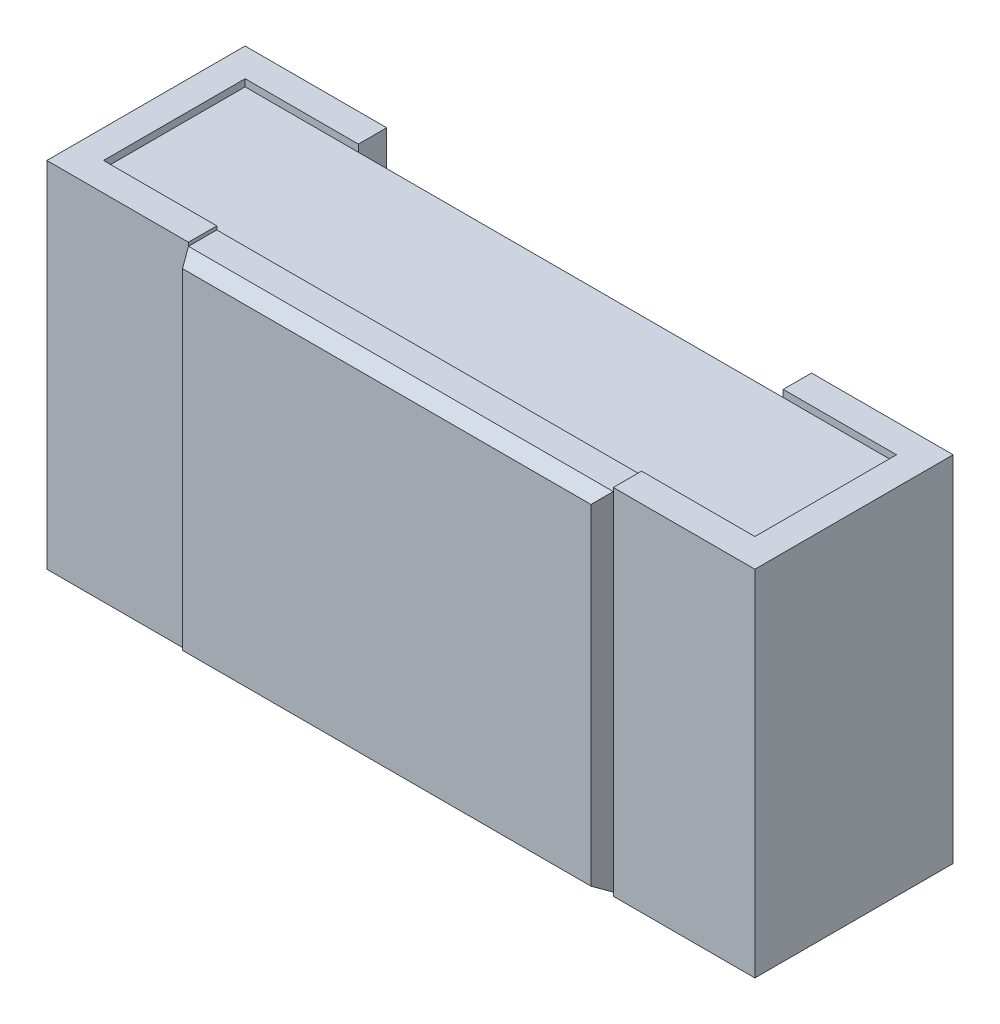
ISO-10303-21;
HEADER;
FILE_DESCRIPTION(('STEP AP214'),'2;1');
FILE_NAME('part.step','',(''),(''),'','','');
FILE_SCHEMA(('AUTOMOTIVE_DESIGN { 1 0 10303 214 1 1 1 1 }'));
ENDSEC;
DATA;
#1=APPLICATION_CONTEXT('core data for automotive mechanical design processes');
#2=APPLICATION_PROTOCOL_DEFINITION('international standard','automotive_design',2000,#1);
#3=PRODUCT_CONTEXT('',#1,'mechanical');
#4=PRODUCT('Part','Part','',(#3));
#5=PRODUCT_RELATED_PRODUCT_CATEGORY('part','',(#4));
#6=PRODUCT_DEFINITION_FORMATION('','',#4);
#7=PRODUCT_DEFINITION_CONTEXT('part definition',#1,'design');
#8=PRODUCT_DEFINITION('design','',#6,#7);
#9=PRODUCT_DEFINITION_SHAPE('','',#8);
#10=(LENGTH_UNIT() NAMED_UNIT(*) SI_UNIT(.MILLI.,.METRE.));
#11=(NAMED_UNIT(*) PLANE_ANGLE_UNIT() SI_UNIT($,.RADIAN.));
#12=(NAMED_UNIT(*) SI_UNIT($,.STERADIAN.) SOLID_ANGLE_UNIT());
#13=UNCERTAINTY_MEASURE_WITH_UNIT(LENGTH_MEASURE(1.E-05),#10,'distance_accuracy_value','');
#14=(GEOMETRIC_REPRESENTATION_CONTEXT(3) GLOBAL_UNCERTAINTY_ASSIGNED_CONTEXT((#13)) GLOBAL_UNIT_ASSIGNED_CONTEXT((#10,
#11,#12)) REPRESENTATION_CONTEXT('',''));
#15=CARTESIAN_POINT('',(0.,0.,0.));
#16=DIRECTION('',(0.,0.,1.));
#17=DIRECTION('',(1.,0.,0.));
#18=AXIS2_PLACEMENT_3D('',#15,#16,#17);
#19=CARTESIAN_POINT('',(0.3,-0.245,0.3));
#20=DIRECTION('',(0.,0.,1.));
#21=DIRECTION('',(1.,0.,0.));
#22=AXIS2_PLACEMENT_3D('',#19,#20,#21);
#23=PLANE('',#22);
#24=DIRECTION('',(0.,1.,0.));
#25=VECTOR('',#24,1.);
#26=CARTESIAN_POINT('',(-0.288452994616207,0.245,0.3));
#27=LINE('',#26,#25);
#28=CARTESIAN_POINT('',(-0.288452994616207,-0.233452994616207,0.3));
#29=VERTEX_POINT('',#28);
#30=CARTESIAN_POINT('',(-0.288452994616207,0.233452994616207,0.3));
#31=VERTEX_POINT('',#30);
#32=EDGE_CURVE('E20',#29,#31,#27,.T.);
#33=ORIENTED_EDGE('',*,*,#32,.F.);
#34=DIRECTION('',(1.,0.,0.));
#35=VECTOR('',#34,1.);
#36=CARTESIAN_POINT('',(-0.3,-0.233452994616207,0.3));
#37=LINE('',#36,#35);
#38=CARTESIAN_POINT('',(0.288452994616207,-0.233452994616207,0.3));
#39=VERTEX_POINT('',#38);
#40=EDGE_CURVE('E203',#39,#29,#37,.F.);
#41=ORIENTED_EDGE('',*,*,#40,.F.);
#42=DIRECTION('',(0.,1.,0.));
#43=VECTOR('',#42,1.);
#44=CARTESIAN_POINT('',(0.288452994616207,0.245,0.3));
#45=LINE('',#44,#43);
#46=CARTESIAN_POINT('',(0.288452994616207,0.233452994616207,0.3));
#47=VERTEX_POINT('',#46);
#48=EDGE_CURVE('E198',#47,#39,#45,.F.);
#49=ORIENTED_EDGE('',*,*,#48,.F.);
#50=DIRECTION('',(1.,0.,0.));
#51=VECTOR('',#50,1.);
#52=CARTESIAN_POINT('',(-0.3,0.233452994616207,0.3));
#53=LINE('',#52,#51);
#54=EDGE_CURVE('E213',#31,#47,#53,.T.);
#55=ORIENTED_EDGE('',*,*,#54,.F.);
#56=EDGE_LOOP('',(#33,#41,#49,#55));
#57=FACE_BOUND('',#56,.T.);
#58=ADVANCED_FACE('F17',(#57),#23,.T.);
#59=CARTESIAN_POINT('',(-0.3,0.245,0.28));
#60=DIRECTION('',(-0.866025403784438,0.,0.500000000000001));
#61=DIRECTION('',(0.500000000000001,0.,0.866025403784438));
#62=AXIS2_PLACEMENT_3D('',#59,#60,#61);
#63=PLANE('',#62);
#64=ORIENTED_EDGE('',*,*,#32,.T.);
#65=DIRECTION('',(0.447213595499959,-0.447213595499958,0.774596669241483));
#66=VECTOR('',#65,1.);
#67=CARTESIAN_POINT('',(-0.3,0.245,0.28));
#68=LINE('',#67,#66);
#69=CARTESIAN_POINT('',(-0.3,0.245,0.28));
#70=VERTEX_POINT('',#69);
#71=EDGE_CURVE('E225',#70,#31,#68,.T.);
#72=ORIENTED_EDGE('',*,*,#71,.F.);
#73=DIRECTION('',(0.,1.,0.));
#74=VECTOR('',#73,1.);
#75=CARTESIAN_POINT('',(-0.3,-0.25,0.28));
#76=LINE('',#75,#74);
#77=CARTESIAN_POINT('',(-0.3,-0.245,0.28));
#78=VERTEX_POINT('',#77);
#79=EDGE_CURVE('E219',#78,#70,#76,.T.);
#80=ORIENTED_EDGE('',*,*,#79,.F.);
#81=DIRECTION('',(-0.447213595499958,-0.447213595499959,-0.774596669241483));
#82=VECTOR('',#81,1.);
#83=CARTESIAN_POINT('',(-0.288452994616207,-0.233452994616207,0.3));
#84=LINE('',#83,#82);
#85=EDGE_CURVE('E208',#29,#78,#84,.T.);
#86=ORIENTED_EDGE('',*,*,#85,.F.);
#87=EDGE_LOOP('',(#64,#72,#80,#86));
#88=FACE_BOUND('',#87,.T.);
#89=ADVANCED_FACE('F218',(#88),#63,.T.);
#90=CARTESIAN_POINT('',(-0.3,-0.245,0.28));
#91=DIRECTION('',(0.,-0.866025403784438,0.500000000000001));
#92=DIRECTION('',(0.,-0.500000000000001,-0.866025403784438));
#93=AXIS2_PLACEMENT_3D('',#90,#91,#92);
#94=PLANE('',#93);
#95=ORIENTED_EDGE('',*,*,#40,.T.);
#96=ORIENTED_EDGE('',*,*,#85,.T.);
#97=DIRECTION('',(1.,0.,0.));
#98=VECTOR('',#97,1.);
#99=CARTESIAN_POINT('',(-0.3,-0.245,0.28));
#100=LINE('',#99,#98);
#101=CARTESIAN_POINT('',(0.3,-0.245,0.28));
#102=VERTEX_POINT('',#101);
#103=EDGE_CURVE('E233',#102,#78,#100,.F.);
#104=ORIENTED_EDGE('',*,*,#103,.F.);
#105=DIRECTION('',(0.447213595499959,-0.447213595499959,-0.774596669241482));
#106=VECTOR('',#105,1.);
#107=CARTESIAN_POINT('',(0.288452994616207,-0.233452994616207,0.3));
#108=LINE('',#107,#106);
#109=EDGE_CURVE('E210',#39,#102,#108,.T.);
#110=ORIENTED_EDGE('',*,*,#109,.F.);
#111=EDGE_LOOP('',(#95,#96,#104,#110));
#112=FACE_BOUND('',#111,.T.);
#113=ADVANCED_FACE('F205',(#112),#94,.T.);
#114=CARTESIAN_POINT('',(0.3,0.245,0.28));
#115=DIRECTION('',(0.866025403784438,0.,0.500000000000001));
#116=DIRECTION('',(0.500000000000001,0.,-0.866025403784438));
#117=AXIS2_PLACEMENT_3D('',#114,#115,#116);
#118=PLANE('',#117);
#119=ORIENTED_EDGE('',*,*,#48,.T.);
#120=ORIENTED_EDGE('',*,*,#109,.T.);
#121=DIRECTION('',(0.,1.,0.));
#122=VECTOR('',#121,1.);
#123=CARTESIAN_POINT('',(0.3,-0.25,0.28));
#124=LINE('',#123,#122);
#125=CARTESIAN_POINT('',(0.3,0.245,0.28));
#126=VERTEX_POINT('',#125);
#127=EDGE_CURVE('E244',#126,#102,#124,.F.);
#128=ORIENTED_EDGE('',*,*,#127,.F.);
#129=DIRECTION('',(0.447213595499956,0.447213595499959,-0.774596669241484));
#130=VECTOR('',#129,1.);
#131=CARTESIAN_POINT('',(0.288452994616207,0.233452994616207,0.3));
#132=LINE('',#131,#130);
#133=EDGE_CURVE('E228',#47,#126,#132,.T.);
#134=ORIENTED_EDGE('',*,*,#133,.F.);
#135=EDGE_LOOP('',(#119,#120,#128,#134));
#136=FACE_BOUND('',#135,.T.);
#137=ADVANCED_FACE('F581',(#136),#118,.T.);
#138=CARTESIAN_POINT('',(-0.3,0.245,0.28));
#139=DIRECTION('',(0.,0.866025403784438,0.500000000000001));
#140=DIRECTION('',(0.,-0.500000000000001,0.866025403784438));
#141=AXIS2_PLACEMENT_3D('',#138,#139,#140);
#142=PLANE('',#141);
#143=ORIENTED_EDGE('',*,*,#54,.T.);
#144=ORIENTED_EDGE('',*,*,#133,.T.);
#145=DIRECTION('',(1.,0.,0.));
#146=VECTOR('',#145,1.);
#147=CARTESIAN_POINT('',(-0.3,0.245,0.28));
#148=LINE('',#147,#146);
#149=EDGE_CURVE('E252',#70,#126,#148,.T.);
#150=ORIENTED_EDGE('',*,*,#149,.F.);
#151=ORIENTED_EDGE('',*,*,#71,.T.);
#152=EDGE_LOOP('',(#143,#144,#150,#151));
#153=FACE_BOUND('',#152,.T.);
#154=ADVANCED_FACE('F577',(#153),#142,.T.);
#155=CARTESIAN_POINT('',(-0.5,-0.25,0.28));
#156=DIRECTION('',(0.,0.,1.));
#157=DIRECTION('',(1.,0.,0.));
#158=AXIS2_PLACEMENT_3D('',#155,#156,#157);
#159=PLANE('',#158);
#160=DIRECTION('',(0.,1.,0.));
#161=VECTOR('',#160,1.);
#162=CARTESIAN_POINT('',(-0.5,-0.25,0.28));
#163=LINE('',#162,#161);
#164=CARTESIAN_POINT('',(-0.5,-0.25,0.28));
#165=VERTEX_POINT('',#164);
#166=CARTESIAN_POINT('',(-0.5,0.25,0.28));
#167=VERTEX_POINT('',#166);
#168=EDGE_CURVE('E231',#165,#167,#163,.T.);
#169=ORIENTED_EDGE('',*,*,#168,.F.);
#170=DIRECTION('',(1.,0.,0.));
#171=VECTOR('',#170,1.);
#172=CARTESIAN_POINT('',(-0.5,-0.25,0.28));
#173=LINE('',#172,#171);
#174=CARTESIAN_POINT('',(-0.3,-0.25,0.28));
#175=VERTEX_POINT('',#174);
#176=EDGE_CURVE('E275',#165,#175,#173,.T.);
#177=ORIENTED_EDGE('',*,*,#176,.T.);
#178=DIRECTION('',(0.,1.,0.));
#179=VECTOR('',#178,1.);
#180=CARTESIAN_POINT('',(-0.3,-0.25,0.28));
#181=LINE('',#180,#179);
#182=EDGE_CURVE('E238',#78,#175,#181,.F.);
#183=ORIENTED_EDGE('',*,*,#182,.F.);
#184=ORIENTED_EDGE('',*,*,#79,.T.);
#185=DIRECTION('',(0.,1.,0.));
#186=VECTOR('',#185,1.);
#187=CARTESIAN_POINT('',(-0.3,-0.25,0.28));
#188=LINE('',#187,#186);
#189=CARTESIAN_POINT('',(-0.3,0.25,0.28));
#190=VERTEX_POINT('',#189);
#191=EDGE_CURVE('E249',#190,#70,#188,.F.);
#192=ORIENTED_EDGE('',*,*,#191,.F.);
#193=DIRECTION('',(1.,0.,0.));
#194=VECTOR('',#193,1.);
#195=CARTESIAN_POINT('',(-0.5,0.25,0.28));
#196=LINE('',#195,#194);
#197=EDGE_CURVE('E268',#167,#190,#196,.T.);
#198=ORIENTED_EDGE('',*,*,#197,.F.);
#199=EDGE_LOOP('',(#169,#177,#183,#184,#192,#198));
#200=FACE_BOUND('',#199,.T.);
#201=ADVANCED_FACE('F573',(#200),#159,.T.);
#202=CARTESIAN_POINT('',(-0.5,-0.25,0.));
#203=DIRECTION('',(-1.,0.,0.));
#204=DIRECTION('',(0.,0.,1.));
#205=AXIS2_PLACEMENT_3D('',#202,#203,#204);
#206=PLANE('',#205);
#207=DIRECTION('',(0.,1.,0.));
#208=VECTOR('',#207,1.);
#209=CARTESIAN_POINT('',(-0.5,-0.25,0.));
#210=LINE('',#209,#208);
#211=CARTESIAN_POINT('',(-0.5,-0.25,0.));
#212=VERTEX_POINT('',#211);
#213=CARTESIAN_POINT('',(-0.5,0.25,0.));
#214=VERTEX_POINT('',#213);
#215=EDGE_CURVE('E263',#212,#214,#210,.T.);
#216=ORIENTED_EDGE('',*,*,#215,.F.);
#217=DIRECTION('',(0.,0.,1.));
#218=VECTOR('',#217,1.);
#219=CARTESIAN_POINT('',(-0.5,-0.25,0.28));
#220=LINE('',#219,#218);
#221=EDGE_CURVE('E284',#212,#165,#220,.T.);
#222=ORIENTED_EDGE('',*,*,#221,.T.);
#223=ORIENTED_EDGE('',*,*,#168,.T.);
#224=DIRECTION('',(0.,0.,1.));
#225=VECTOR('',#224,1.);
#226=CARTESIAN_POINT('',(-0.5,0.25,0.28));
#227=LINE('',#226,#225);
#228=EDGE_CURVE('E265',#214,#167,#227,.T.);
#229=ORIENTED_EDGE('',*,*,#228,.F.);
#230=EDGE_LOOP('',(#216,#222,#223,#229));
#231=FACE_BOUND('',#230,.T.);
#232=ADVANCED_FACE('F569',(#231),#206,.T.);
#233=CARTESIAN_POINT('',(-0.3,-0.245,0.24));
#234=DIRECTION('',(0.,-1.,0.));
#235=DIRECTION('',(0.,0.,-1.));
#236=AXIS2_PLACEMENT_3D('',#233,#234,#235);
#237=PLANE('',#236);
#238=DIRECTION('',(-1.,0.,0.));
#239=VECTOR('',#238,1.);
#240=CARTESIAN_POINT('',(-0.3,-0.245,0.24));
#241=LINE('',#240,#239);
#242=CARTESIAN_POINT('',(0.3,-0.245,0.24));
#243=VERTEX_POINT('',#242);
#244=CARTESIAN_POINT('',(-0.3,-0.245,0.24));
#245=VERTEX_POINT('',#244);
#246=EDGE_CURVE('E292',#243,#245,#241,.T.);
#247=ORIENTED_EDGE('',*,*,#246,.F.);
#248=DIRECTION('',(0.,0.,1.));
#249=VECTOR('',#248,1.);
#250=CARTESIAN_POINT('',(0.3,-0.245,0.28));
#251=LINE('',#250,#249);
#252=EDGE_CURVE('E240',#102,#243,#251,.F.);
#253=ORIENTED_EDGE('',*,*,#252,.F.);
#254=ORIENTED_EDGE('',*,*,#103,.T.);
#255=DIRECTION('',(0.,0.,-1.));
#256=VECTOR('',#255,1.);
#257=CARTESIAN_POINT('',(-0.3,-0.245,0.28));
#258=LINE('',#257,#256);
#259=EDGE_CURVE('E235',#245,#78,#258,.F.);
#260=ORIENTED_EDGE('',*,*,#259,.F.);
#261=EDGE_LOOP('',(#247,#253,#254,#260));
#262=FACE_BOUND('',#261,.T.);
#263=ADVANCED_FACE('F565',(#262),#237,.T.);
#264=CARTESIAN_POINT('',(-0.3,-0.25,0.28));
#265=DIRECTION('',(1.,0.,0.));
#266=DIRECTION('',(0.,0.,-1.));
#267=AXIS2_PLACEMENT_3D('',#264,#265,#266);
#268=PLANE('',#267);
#269=DIRECTION('',(0.,0.,1.));
#270=VECTOR('',#269,1.);
#271=CARTESIAN_POINT('',(-0.3,-0.25,0.28));
#272=LINE('',#271,#270);
#273=CARTESIAN_POINT('',(-0.3,-0.25,0.24));
#274=VERTEX_POINT('',#273);
#275=EDGE_CURVE('E278',#175,#274,#272,.F.);
#276=ORIENTED_EDGE('',*,*,#275,.T.);
#277=DIRECTION('',(0.,1.,0.));
#278=VECTOR('',#277,1.);
#279=CARTESIAN_POINT('',(-0.3,-0.25,0.24));
#280=LINE('',#279,#278);
#281=EDGE_CURVE('E294',#245,#274,#280,.F.);
#282=ORIENTED_EDGE('',*,*,#281,.F.);
#283=ORIENTED_EDGE('',*,*,#259,.T.);
#284=ORIENTED_EDGE('',*,*,#182,.T.);
#285=EDGE_LOOP('',(#276,#282,#283,#284));
#286=FACE_BOUND('',#285,.T.);
#287=ADVANCED_FACE('F561',(#286),#268,.T.);
#288=CARTESIAN_POINT('',(0.3,-0.25,0.28));
#289=DIRECTION('',(-1.,0.,0.));
#290=DIRECTION('',(0.,0.,1.));
#291=AXIS2_PLACEMENT_3D('',#288,#289,#290);
#292=PLANE('',#291);
#293=DIRECTION('',(0.,0.,-1.));
#294=VECTOR('',#293,1.);
#295=CARTESIAN_POINT('',(0.3,-0.25,0.24));
#296=LINE('',#295,#294);
#297=CARTESIAN_POINT('',(0.3,-0.25,0.28));
#298=VERTEX_POINT('',#297);
#299=CARTESIAN_POINT('',(0.3,-0.25,0.24));
#300=VERTEX_POINT('',#299);
#301=EDGE_CURVE('E323',#298,#300,#296,.T.);
#302=ORIENTED_EDGE('',*,*,#301,.F.);
#303=DIRECTION('',(0.,1.,0.));
#304=VECTOR('',#303,1.);
#305=CARTESIAN_POINT('',(0.3,-0.25,0.28));
#306=LINE('',#305,#304);
#307=EDGE_CURVE('E247',#102,#298,#306,.F.);
#308=ORIENTED_EDGE('',*,*,#307,.F.);
#309=ORIENTED_EDGE('',*,*,#252,.T.);
#310=DIRECTION('',(0.,1.,0.));
#311=VECTOR('',#310,1.);
#312=CARTESIAN_POINT('',(0.3,-0.25,0.24));
#313=LINE('',#312,#311);
#314=EDGE_CURVE('E289',#300,#243,#313,.T.);
#315=ORIENTED_EDGE('',*,*,#314,.F.);
#316=EDGE_LOOP('',(#302,#308,#309,#315));
#317=FACE_BOUND('',#316,.T.);
#318=ADVANCED_FACE('F557',(#317),#292,.T.);
#319=CARTESIAN_POINT('',(0.5,-0.25,0.));
#320=DIRECTION('',(1.,0.,0.));
#321=DIRECTION('',(0.,0.,-1.));
#322=AXIS2_PLACEMENT_3D('',#319,#320,#321);
#323=PLANE('',#322);
#324=DIRECTION('',(0.,1.,0.));
#325=VECTOR('',#324,1.);
#326=CARTESIAN_POINT('',(0.5,-0.25,0.28));
#327=LINE('',#326,#325);
#328=CARTESIAN_POINT('',(0.5,-0.25,0.28));
#329=VERTEX_POINT('',#328);
#330=CARTESIAN_POINT('',(0.5,0.25,0.28));
#331=VERTEX_POINT('',#330);
#332=EDGE_CURVE('E242',#329,#331,#327,.T.);
#333=ORIENTED_EDGE('',*,*,#332,.F.);
#334=DIRECTION('',(0.,0.,-1.));
#335=VECTOR('',#334,1.);
#336=CARTESIAN_POINT('',(0.5,-0.25,0.24));
#337=LINE('',#336,#335);
#338=CARTESIAN_POINT('',(0.5,-0.25,0.));
#339=VERTEX_POINT('',#338);
#340=EDGE_CURVE('E334',#339,#329,#337,.F.);
#341=ORIENTED_EDGE('',*,*,#340,.F.);
#342=DIRECTION('',(0.,1.,0.));
#343=VECTOR('',#342,1.);
#344=CARTESIAN_POINT('',(0.5,-0.25,0.));
#345=LINE('',#344,#343);
#346=CARTESIAN_POINT('',(0.5,0.25,0.));
#347=VERTEX_POINT('',#346);
#348=EDGE_CURVE('E321',#347,#339,#345,.F.);
#349=ORIENTED_EDGE('',*,*,#348,.F.);
#350=DIRECTION('',(0.,0.,-1.));
#351=VECTOR('',#350,1.);
#352=CARTESIAN_POINT('',(0.5,0.25,0.24));
#353=LINE('',#352,#351);
#354=EDGE_CURVE('E309',#347,#331,#353,.F.);
#355=ORIENTED_EDGE('',*,*,#354,.T.);
#356=EDGE_LOOP('',(#333,#341,#349,#355));
#357=FACE_BOUND('',#356,.T.);
#358=ADVANCED_FACE('F553',(#357),#323,.T.);
#359=CARTESIAN_POINT('',(0.5,-0.25,0.28));
#360=DIRECTION('',(0.,0.,1.));
#361=DIRECTION('',(1.,0.,0.));
#362=AXIS2_PLACEMENT_3D('',#359,#360,#361);
#363=PLANE('',#362);
#364=ORIENTED_EDGE('',*,*,#307,.T.);
#365=DIRECTION('',(1.,0.,0.));
#366=VECTOR('',#365,1.);
#367=CARTESIAN_POINT('',(0.3,-0.25,0.28));
#368=LINE('',#367,#366);
#369=EDGE_CURVE('E336',#329,#298,#368,.F.);
#370=ORIENTED_EDGE('',*,*,#369,.F.);
#371=ORIENTED_EDGE('',*,*,#332,.T.);
#372=DIRECTION('',(1.,0.,0.));
#373=VECTOR('',#372,1.);
#374=CARTESIAN_POINT('',(0.3,0.25,0.28));
#375=LINE('',#374,#373);
#376=CARTESIAN_POINT('',(0.3,0.25,0.28));
#377=VERTEX_POINT('',#376);
#378=EDGE_CURVE('E312',#331,#377,#375,.F.);
#379=ORIENTED_EDGE('',*,*,#378,.T.);
#380=DIRECTION('',(0.,1.,0.));
#381=VECTOR('',#380,1.);
#382=CARTESIAN_POINT('',(0.3,-0.25,0.28));
#383=LINE('',#382,#381);
#384=EDGE_CURVE('E261',#126,#377,#383,.T.);
#385=ORIENTED_EDGE('',*,*,#384,.F.);
#386=ORIENTED_EDGE('',*,*,#127,.T.);
#387=EDGE_LOOP('',(#364,#370,#371,#379,#385,#386));
#388=FACE_BOUND('',#387,.T.);
#389=ADVANCED_FACE('F549',(#388),#363,.T.);
#390=CARTESIAN_POINT('',(-0.3,-0.25,0.28));
#391=DIRECTION('',(1.,0.,0.));
#392=DIRECTION('',(0.,0.,-1.));
#393=AXIS2_PLACEMENT_3D('',#390,#391,#392);
#394=PLANE('',#393);
#395=DIRECTION('',(0.,0.,1.));
#396=VECTOR('',#395,1.);
#397=CARTESIAN_POINT('',(-0.3,0.25,0.28));
#398=LINE('',#397,#396);
#399=CARTESIAN_POINT('',(-0.3,0.25,0.24));
#400=VERTEX_POINT('',#399);
#401=EDGE_CURVE('E270',#190,#400,#398,.F.);
#402=ORIENTED_EDGE('',*,*,#401,.F.);
#403=ORIENTED_EDGE('',*,*,#191,.T.);
#404=DIRECTION('',(0.,0.,1.));
#405=VECTOR('',#404,1.);
#406=CARTESIAN_POINT('',(-0.3,0.245,0.24));
#407=LINE('',#406,#405);
#408=CARTESIAN_POINT('',(-0.3,0.245,0.24));
#409=VERTEX_POINT('',#408);
#410=EDGE_CURVE('E255',#409,#70,#407,.T.);
#411=ORIENTED_EDGE('',*,*,#410,.F.);
#412=DIRECTION('',(0.,1.,0.));
#413=VECTOR('',#412,1.);
#414=CARTESIAN_POINT('',(-0.3,-0.25,0.24));
#415=LINE('',#414,#413);
#416=EDGE_CURVE('E344',#400,#409,#415,.F.);
#417=ORIENTED_EDGE('',*,*,#416,.F.);
#418=EDGE_LOOP('',(#402,#403,#411,#417));
#419=FACE_BOUND('',#418,.T.);
#420=ADVANCED_FACE('F545',(#419),#394,.T.);
#421=CARTESIAN_POINT('',(-0.3,0.245,0.24));
#422=DIRECTION('',(0.,1.,0.));
#423=DIRECTION('',(0.,0.,1.));
#424=AXIS2_PLACEMENT_3D('',#421,#422,#423);
#425=PLANE('',#424);
#426=DIRECTION('',(-1.,0.,0.));
#427=VECTOR('',#426,1.);
#428=CARTESIAN_POINT('',(-0.3,0.245,0.24));
#429=LINE('',#428,#427);
#430=CARTESIAN_POINT('',(0.3,0.245,0.24));
#431=VERTEX_POINT('',#430);
#432=EDGE_CURVE('E346',#409,#431,#429,.F.);
#433=ORIENTED_EDGE('',*,*,#432,.F.);
#434=ORIENTED_EDGE('',*,*,#410,.T.);
#435=ORIENTED_EDGE('',*,*,#149,.T.);
#436=DIRECTION('',(0.,0.,1.));
#437=VECTOR('',#436,1.);
#438=CARTESIAN_POINT('',(0.3,0.245,0.28));
#439=LINE('',#438,#437);
#440=EDGE_CURVE('E258',#431,#126,#439,.T.);
#441=ORIENTED_EDGE('',*,*,#440,.F.);
#442=EDGE_LOOP('',(#433,#434,#435,#441));
#443=FACE_BOUND('',#442,.T.);
#444=ADVANCED_FACE('F541',(#443),#425,.T.);
#445=CARTESIAN_POINT('',(0.3,-0.25,0.28));
#446=DIRECTION('',(-1.,0.,0.));
#447=DIRECTION('',(0.,0.,1.));
#448=AXIS2_PLACEMENT_3D('',#445,#446,#447);
#449=PLANE('',#448);
#450=DIRECTION('',(0.,0.,-1.));
#451=VECTOR('',#450,1.);
#452=CARTESIAN_POINT('',(0.3,0.25,0.24));
#453=LINE('',#452,#451);
#454=CARTESIAN_POINT('',(0.3,0.25,0.24));
#455=VERTEX_POINT('',#454);
#456=EDGE_CURVE('E315',#377,#455,#453,.T.);
#457=ORIENTED_EDGE('',*,*,#456,.T.);
#458=DIRECTION('',(0.,1.,0.));
#459=VECTOR('',#458,1.);
#460=CARTESIAN_POINT('',(0.3,-0.25,0.24));
#461=LINE('',#460,#459);
#462=EDGE_CURVE('E348',#431,#455,#461,.T.);
#463=ORIENTED_EDGE('',*,*,#462,.F.);
#464=ORIENTED_EDGE('',*,*,#440,.T.);
#465=ORIENTED_EDGE('',*,*,#384,.T.);
#466=EDGE_LOOP('',(#457,#463,#464,#465));
#467=FACE_BOUND('',#466,.T.);
#468=ADVANCED_FACE('F538',(#467),#449,.T.);
#469=CARTESIAN_POINT('',(-0.5,-0.25,0.));
#470=DIRECTION('',(0.,0.,-1.));
#471=DIRECTION('',(-1.,0.,0.));
#472=AXIS2_PLACEMENT_3D('',#469,#470,#471);
#473=PLANE('',#472);
#474=DIRECTION('',(0.,1.,0.));
#475=VECTOR('',#474,1.);
#476=CARTESIAN_POINT('',(-0.3,-0.25,0.));
#477=LINE('',#476,#475);
#478=CARTESIAN_POINT('',(-0.3,-0.25,0.));
#479=VERTEX_POINT('',#478);
#480=CARTESIAN_POINT('',(-0.3,0.25,0.));
#481=VERTEX_POINT('',#480);
#482=EDGE_CURVE('E367',#479,#481,#477,.T.);
#483=ORIENTED_EDGE('',*,*,#482,.F.);
#484=DIRECTION('',(1.,0.,0.));
#485=VECTOR('',#484,1.);
#486=CARTESIAN_POINT('',(-0.5,-0.25,0.));
#487=LINE('',#486,#485);
#488=EDGE_CURVE('E281',#479,#212,#487,.F.);
#489=ORIENTED_EDGE('',*,*,#488,.T.);
#490=ORIENTED_EDGE('',*,*,#215,.T.);
#491=DIRECTION('',(1.,0.,0.));
#492=VECTOR('',#491,1.);
#493=CARTESIAN_POINT('',(-0.5,0.25,0.));
#494=LINE('',#493,#492);
#495=EDGE_CURVE('E272',#481,#214,#494,.F.);
#496=ORIENTED_EDGE('',*,*,#495,.F.);
#497=EDGE_LOOP('',(#483,#489,#490,#496));
#498=FACE_BOUND('',#497,.T.);
#499=ADVANCED_FACE('F455',(#498),#473,.T.);
#500=CARTESIAN_POINT('',(-0.5,0.25,0.28));
#501=DIRECTION('',(0.,1.,0.));
#502=DIRECTION('',(0.,0.,1.));
#503=AXIS2_PLACEMENT_3D('',#500,#501,#502);
#504=PLANE('',#503);
#505=DIRECTION('',(0.,0.,-1.));
#506=VECTOR('',#505,1.);
#507=CARTESIAN_POINT('',(-0.3,0.25,0.));
#508=LINE('',#507,#506);
#509=CARTESIAN_POINT('',(-0.3,0.25,0.04));
#510=VERTEX_POINT('',#509);
#511=EDGE_CURVE('E369',#481,#510,#508,.F.);
#512=ORIENTED_EDGE('',*,*,#511,.F.);
#513=ORIENTED_EDGE('',*,*,#495,.T.);
#514=ORIENTED_EDGE('',*,*,#228,.T.);
#515=ORIENTED_EDGE('',*,*,#197,.T.);
#516=ORIENTED_EDGE('',*,*,#401,.T.);
#517=DIRECTION('',(-1.,0.,0.));
#518=VECTOR('',#517,1.);
#519=CARTESIAN_POINT('',(-0.3,0.25,0.24));
#520=LINE('',#519,#518);
#521=CARTESIAN_POINT('',(-0.46,0.25,0.24));
#522=VERTEX_POINT('',#521);
#523=EDGE_CURVE('E341',#522,#400,#520,.F.);
#524=ORIENTED_EDGE('',*,*,#523,.F.);
#525=DIRECTION('',(0.,0.,-1.));
#526=VECTOR('',#525,1.);
#527=CARTESIAN_POINT('',(-0.46,0.25,0.04));
#528=LINE('',#527,#526);
#529=CARTESIAN_POINT('',(-0.46,0.25,0.04));
#530=VERTEX_POINT('',#529);
#531=EDGE_CURVE('E354',#530,#522,#528,.F.);
#532=ORIENTED_EDGE('',*,*,#531,.F.);
#533=DIRECTION('',(1.,0.,0.));
#534=VECTOR('',#533,1.);
#535=CARTESIAN_POINT('',(-0.46,0.25,0.04));
#536=LINE('',#535,#534);
#537=EDGE_CURVE('E358',#510,#530,#536,.F.);
#538=ORIENTED_EDGE('',*,*,#537,.F.);
#539=EDGE_LOOP('',(#512,#513,#514,#515,#516,#524,#532,#538));
#540=FACE_BOUND('',#539,.T.);
#541=ADVANCED_FACE('F462',(#540),#504,.T.);
#542=CARTESIAN_POINT('',(-0.5,-0.25,0.28));
#543=DIRECTION('',(0.,1.,0.));
#544=DIRECTION('',(0.,0.,1.));
#545=AXIS2_PLACEMENT_3D('',#542,#543,#544);
#546=PLANE('',#545);
#547=ORIENTED_EDGE('',*,*,#488,.F.);
#548=DIRECTION('',(0.,0.,-1.));
#549=VECTOR('',#548,1.);
#550=CARTESIAN_POINT('',(-0.3,-0.25,0.));
#551=LINE('',#550,#549);
#552=CARTESIAN_POINT('',(-0.3,-0.25,0.04));
#553=VERTEX_POINT('',#552);
#554=EDGE_CURVE('E376',#553,#479,#551,.T.);
#555=ORIENTED_EDGE('',*,*,#554,.F.);
#556=DIRECTION('',(1.,0.,0.));
#557=VECTOR('',#556,1.);
#558=CARTESIAN_POINT('',(-0.46,-0.25,0.04));
#559=LINE('',#558,#557);
#560=CARTESIAN_POINT('',(-0.46,-0.25,0.04));
#561=VERTEX_POINT('',#560);
#562=EDGE_CURVE('E305',#561,#553,#559,.T.);
#563=ORIENTED_EDGE('',*,*,#562,.F.);
#564=DIRECTION('',(0.,0.,-1.));
#565=VECTOR('',#564,1.);
#566=CARTESIAN_POINT('',(-0.46,-0.25,0.04));
#567=LINE('',#566,#565);
#568=CARTESIAN_POINT('',(-0.46,-0.25,0.24));
#569=VERTEX_POINT('',#568);
#570=EDGE_CURVE('E287',#569,#561,#567,.T.);
#571=ORIENTED_EDGE('',*,*,#570,.F.);
#572=DIRECTION('',(-1.,0.,0.));
#573=VECTOR('',#572,1.);
#574=CARTESIAN_POINT('',(-0.3,-0.25,0.24));
#575=LINE('',#574,#573);
#576=EDGE_CURVE('E296',#274,#569,#575,.T.);
#577=ORIENTED_EDGE('',*,*,#576,.F.);
#578=ORIENTED_EDGE('',*,*,#275,.F.);
#579=ORIENTED_EDGE('',*,*,#176,.F.);
#580=ORIENTED_EDGE('',*,*,#221,.F.);
#581=EDGE_LOOP('',(#547,#555,#563,#571,#577,#578,#579,#580));
#582=FACE_BOUND('',#581,.T.);
#583=ADVANCED_FACE('F451',(#582),#546,.F.);
#584=CARTESIAN_POINT('',(-0.46,-0.25,0.04));
#585=DIRECTION('',(1.,0.,0.));
#586=DIRECTION('',(0.,0.,-1.));
#587=AXIS2_PLACEMENT_3D('',#584,#585,#586);
#588=PLANE('',#587);
#589=ORIENTED_EDGE('',*,*,#570,.T.);
#590=DIRECTION('',(0.,1.,0.));
#591=VECTOR('',#590,1.);
#592=CARTESIAN_POINT('',(-0.46,-0.25,0.04));
#593=LINE('',#592,#591);
#594=CARTESIAN_POINT('',(-0.46,-0.24,0.04));
#595=VERTEX_POINT('',#594);
#596=EDGE_CURVE('E302',#595,#561,#593,.F.);
#597=ORIENTED_EDGE('',*,*,#596,.F.);
#598=DIRECTION('',(0.,0.,1.));
#599=VECTOR('',#598,1.);
#600=CARTESIAN_POINT('',(-0.46,-0.24,0.24));
#601=LINE('',#600,#599);
#602=CARTESIAN_POINT('',(-0.46,-0.24,0.24));
#603=VERTEX_POINT('',#602);
#604=EDGE_CURVE('E379',#595,#603,#601,.T.);
#605=ORIENTED_EDGE('',*,*,#604,.T.);
#606=DIRECTION('',(0.,1.,0.));
#607=VECTOR('',#606,1.);
#608=CARTESIAN_POINT('',(-0.46,-0.25,0.24));
#609=LINE('',#608,#607);
#610=EDGE_CURVE('E298',#569,#603,#609,.T.);
#611=ORIENTED_EDGE('',*,*,#610,.F.);
#612=EDGE_LOOP('',(#589,#597,#605,#611));
#613=FACE_BOUND('',#612,.T.);
#614=ADVANCED_FACE('F527',(#613),#588,.T.);
#615=CARTESIAN_POINT('',(-0.3,-0.25,0.24));
#616=DIRECTION('',(0.,0.,-1.));
#617=DIRECTION('',(-1.,0.,0.));
#618=AXIS2_PLACEMENT_3D('',#615,#616,#617);
#619=PLANE('',#618);
#620=ORIENTED_EDGE('',*,*,#576,.T.);
#621=ORIENTED_EDGE('',*,*,#610,.T.);
#622=DIRECTION('',(1.,0.,0.));
#623=VECTOR('',#622,1.);
#624=CARTESIAN_POINT('',(-0.46,-0.24,0.24));
#625=LINE('',#624,#623);
#626=CARTESIAN_POINT('',(0.46,-0.24,0.24));
#627=VERTEX_POINT('',#626);
#628=EDGE_CURVE('E382',#603,#627,#625,.T.);
#629=ORIENTED_EDGE('',*,*,#628,.T.);
#630=DIRECTION('',(0.,1.,0.));
#631=VECTOR('',#630,1.);
#632=CARTESIAN_POINT('',(0.46,-0.25,0.24));
#633=LINE('',#632,#631);
#634=CARTESIAN_POINT('',(0.46,-0.25,0.24));
#635=VERTEX_POINT('',#634);
#636=EDGE_CURVE('E300',#635,#627,#633,.T.);
#637=ORIENTED_EDGE('',*,*,#636,.F.);
#638=DIRECTION('',(1.,0.,0.));
#639=VECTOR('',#638,1.);
#640=CARTESIAN_POINT('',(0.3,-0.25,0.24));
#641=LINE('',#640,#639);
#642=EDGE_CURVE('E325',#300,#635,#641,.T.);
#643=ORIENTED_EDGE('',*,*,#642,.F.);
#644=ORIENTED_EDGE('',*,*,#314,.T.);
#645=ORIENTED_EDGE('',*,*,#246,.T.);
#646=ORIENTED_EDGE('',*,*,#281,.T.);
#647=EDGE_LOOP('',(#620,#621,#629,#637,#643,#644,#645,#646));
#648=FACE_BOUND('',#647,.T.);
#649=ADVANCED_FACE('F523',(#648),#619,.T.);
#650=CARTESIAN_POINT('',(0.46,-0.25,0.04));
#651=DIRECTION('',(-1.,0.,0.));
#652=DIRECTION('',(0.,0.,1.));
#653=AXIS2_PLACEMENT_3D('',#650,#651,#652);
#654=PLANE('',#653);
#655=DIRECTION('',(0.,0.,-1.));
#656=VECTOR('',#655,1.);
#657=CARTESIAN_POINT('',(0.46,-0.25,0.24));
#658=LINE('',#657,#656);
#659=CARTESIAN_POINT('',(0.46,-0.25,0.04));
#660=VERTEX_POINT('',#659);
#661=EDGE_CURVE('E327',#635,#660,#658,.T.);
#662=ORIENTED_EDGE('',*,*,#661,.F.);
#663=ORIENTED_EDGE('',*,*,#636,.T.);
#664=DIRECTION('',(0.,0.,1.));
#665=VECTOR('',#664,1.);
#666=CARTESIAN_POINT('',(0.46,-0.24,0.24));
#667=LINE('',#666,#665);
#668=CARTESIAN_POINT('',(0.46,-0.24,0.04));
#669=VERTEX_POINT('',#668);
#670=EDGE_CURVE('E385',#627,#669,#667,.F.);
#671=ORIENTED_EDGE('',*,*,#670,.T.);
#672=DIRECTION('',(0.,1.,0.));
#673=VECTOR('',#672,1.);
#674=CARTESIAN_POINT('',(0.46,-0.25,0.04));
#675=LINE('',#674,#673);
#676=EDGE_CURVE('E307',#660,#669,#675,.T.);
#677=ORIENTED_EDGE('',*,*,#676,.F.);
#678=EDGE_LOOP('',(#662,#663,#671,#677));
#679=FACE_BOUND('',#678,.T.);
#680=ADVANCED_FACE('F520',(#679),#654,.T.);
#681=CARTESIAN_POINT('',(-0.46,-0.25,0.04));
#682=DIRECTION('',(0.,0.,1.));
#683=DIRECTION('',(1.,0.,0.));
#684=AXIS2_PLACEMENT_3D('',#681,#682,#683);
#685=PLANE('',#684);
#686=ORIENTED_EDGE('',*,*,#562,.T.);
#687=DIRECTION('',(0.,1.,0.));
#688=VECTOR('',#687,1.);
#689=CARTESIAN_POINT('',(-0.3,-0.25,0.04));
#690=LINE('',#689,#688);
#691=CARTESIAN_POINT('',(-0.3,-0.24,0.04));
#692=VERTEX_POINT('',#691);
#693=EDGE_CURVE('E373',#692,#553,#690,.F.);
#694=ORIENTED_EDGE('',*,*,#693,.F.);
#695=DIRECTION('',(1.,0.,0.));
#696=VECTOR('',#695,1.);
#697=CARTESIAN_POINT('',(-0.46,-0.24,0.04));
#698=LINE('',#697,#696);
#699=EDGE_CURVE('E391',#692,#595,#698,.F.);
#700=ORIENTED_EDGE('',*,*,#699,.T.);
#701=ORIENTED_EDGE('',*,*,#596,.T.);
#702=EDGE_LOOP('',(#686,#694,#700,#701));
#703=FACE_BOUND('',#702,.T.);
#704=ADVANCED_FACE('F444',(#703),#685,.T.);
#705=CARTESIAN_POINT('',(0.46,-0.25,0.04));
#706=DIRECTION('',(0.,0.,1.));
#707=DIRECTION('',(1.,0.,0.));
#708=AXIS2_PLACEMENT_3D('',#705,#706,#707);
#709=PLANE('',#708);
#710=DIRECTION('',(1.,0.,0.));
#711=VECTOR('',#710,1.);
#712=CARTESIAN_POINT('',(0.3,-0.25,0.04));
#713=LINE('',#712,#711);
#714=CARTESIAN_POINT('',(0.3,-0.25,0.04));
#715=VERTEX_POINT('',#714);
#716=EDGE_CURVE('E329',#660,#715,#713,.F.);
#717=ORIENTED_EDGE('',*,*,#716,.F.);
#718=ORIENTED_EDGE('',*,*,#676,.T.);
#719=DIRECTION('',(1.,0.,0.));
#720=VECTOR('',#719,1.);
#721=CARTESIAN_POINT('',(-0.46,-0.24,0.04));
#722=LINE('',#721,#720);
#723=CARTESIAN_POINT('',(0.3,-0.24,0.04));
#724=VERTEX_POINT('',#723);
#725=EDGE_CURVE('E388',#669,#724,#722,.F.);
#726=ORIENTED_EDGE('',*,*,#725,.T.);
#727=DIRECTION('',(0.,1.,0.));
#728=VECTOR('',#727,1.);
#729=CARTESIAN_POINT('',(0.3,-0.25,0.04));
#730=LINE('',#729,#728);
#731=EDGE_CURVE('E394',#715,#724,#730,.T.);
#732=ORIENTED_EDGE('',*,*,#731,.F.);
#733=EDGE_LOOP('',(#717,#718,#726,#732));
#734=FACE_BOUND('',#733,.T.);
#735=ADVANCED_FACE('F513',(#734),#709,.T.);
#736=CARTESIAN_POINT('',(0.3,0.25,0.24));
#737=DIRECTION('',(0.,-1.,0.));
#738=DIRECTION('',(0.,0.,-1.));
#739=AXIS2_PLACEMENT_3D('',#736,#737,#738);
#740=PLANE('',#739);
#741=ORIENTED_EDGE('',*,*,#378,.F.);
#742=ORIENTED_EDGE('',*,*,#354,.F.);
#743=DIRECTION('',(-1.,0.,0.));
#744=VECTOR('',#743,1.);
#745=CARTESIAN_POINT('',(0.5,0.25,0.));
#746=LINE('',#745,#744);
#747=CARTESIAN_POINT('',(0.3,0.25,0.));
#748=VERTEX_POINT('',#747);
#749=EDGE_CURVE('E318',#748,#347,#746,.F.);
#750=ORIENTED_EDGE('',*,*,#749,.F.);
#751=DIRECTION('',(0.,0.,1.));
#752=VECTOR('',#751,1.);
#753=CARTESIAN_POINT('',(0.3,0.25,0.));
#754=LINE('',#753,#752);
#755=CARTESIAN_POINT('',(0.3,0.25,0.04));
#756=VERTEX_POINT('',#755);
#757=EDGE_CURVE('E399',#756,#748,#754,.F.);
#758=ORIENTED_EDGE('',*,*,#757,.F.);
#759=DIRECTION('',(1.,0.,0.));
#760=VECTOR('',#759,1.);
#761=CARTESIAN_POINT('',(0.46,0.25,0.04));
#762=LINE('',#761,#760);
#763=CARTESIAN_POINT('',(0.46,0.25,0.04));
#764=VERTEX_POINT('',#763);
#765=EDGE_CURVE('E365',#764,#756,#762,.F.);
#766=ORIENTED_EDGE('',*,*,#765,.F.);
#767=DIRECTION('',(0.,0.,1.));
#768=VECTOR('',#767,1.);
#769=CARTESIAN_POINT('',(0.46,0.25,0.04));
#770=LINE('',#769,#768);
#771=CARTESIAN_POINT('',(0.46,0.25,0.24));
#772=VERTEX_POINT('',#771);
#773=EDGE_CURVE('E339',#772,#764,#770,.F.);
#774=ORIENTED_EDGE('',*,*,#773,.F.);
#775=DIRECTION('',(-1.,0.,0.));
#776=VECTOR('',#775,1.);
#777=CARTESIAN_POINT('',(-0.3,0.25,0.24));
#778=LINE('',#777,#776);
#779=EDGE_CURVE('E350',#455,#772,#778,.F.);
#780=ORIENTED_EDGE('',*,*,#779,.F.);
#781=ORIENTED_EDGE('',*,*,#456,.F.);
#782=EDGE_LOOP('',(#741,#742,#750,#758,#766,#774,#780,#781));
#783=FACE_BOUND('',#782,.T.);
#784=ADVANCED_FACE('F509',(#783),#740,.F.);
#785=CARTESIAN_POINT('',(0.5,-0.25,0.));
#786=DIRECTION('',(0.,0.,-1.));
#787=DIRECTION('',(-1.,0.,0.));
#788=AXIS2_PLACEMENT_3D('',#785,#786,#787);
#789=PLANE('',#788);
#790=ORIENTED_EDGE('',*,*,#348,.T.);
#791=DIRECTION('',(1.,0.,0.));
#792=VECTOR('',#791,1.);
#793=CARTESIAN_POINT('',(0.3,-0.25,0.));
#794=LINE('',#793,#792);
#795=CARTESIAN_POINT('',(0.3,-0.25,0.));
#796=VERTEX_POINT('',#795);
#797=EDGE_CURVE('E331',#796,#339,#794,.T.);
#798=ORIENTED_EDGE('',*,*,#797,.F.);
#799=DIRECTION('',(0.,1.,0.));
#800=VECTOR('',#799,1.);
#801=CARTESIAN_POINT('',(0.3,-0.25,0.));
#802=LINE('',#801,#800);
#803=EDGE_CURVE('E401',#748,#796,#802,.F.);
#804=ORIENTED_EDGE('',*,*,#803,.F.);
#805=ORIENTED_EDGE('',*,*,#749,.T.);
#806=EDGE_LOOP('',(#790,#798,#804,#805));
#807=FACE_BOUND('',#806,.T.);
#808=ADVANCED_FACE('F505',(#807),#789,.T.);
#809=CARTESIAN_POINT('',(0.3,-0.25,0.24));
#810=DIRECTION('',(0.,-1.,0.));
#811=DIRECTION('',(0.,0.,-1.));
#812=AXIS2_PLACEMENT_3D('',#809,#810,#811);
#813=PLANE('',#812);
#814=ORIENTED_EDGE('',*,*,#340,.T.);
#815=ORIENTED_EDGE('',*,*,#369,.T.);
#816=ORIENTED_EDGE('',*,*,#301,.T.);
#817=ORIENTED_EDGE('',*,*,#642,.T.);
#818=ORIENTED_EDGE('',*,*,#661,.T.);
#819=ORIENTED_EDGE('',*,*,#716,.T.);
#820=DIRECTION('',(0.,0.,1.));
#821=VECTOR('',#820,1.);
#822=CARTESIAN_POINT('',(0.3,-0.25,0.));
#823=LINE('',#822,#821);
#824=EDGE_CURVE('E403',#796,#715,#823,.T.);
#825=ORIENTED_EDGE('',*,*,#824,.F.);
#826=ORIENTED_EDGE('',*,*,#797,.T.);
#827=EDGE_LOOP('',(#814,#815,#816,#817,#818,#819,#825,#826));
#828=FACE_BOUND('',#827,.T.);
#829=ADVANCED_FACE('F501',(#828),#813,.T.);
#830=CARTESIAN_POINT('',(0.46,-0.25,0.04));
#831=DIRECTION('',(-1.,0.,0.));
#832=DIRECTION('',(0.,0.,1.));
#833=AXIS2_PLACEMENT_3D('',#830,#831,#832);
#834=PLANE('',#833);
#835=ORIENTED_EDGE('',*,*,#773,.T.);
#836=DIRECTION('',(0.,1.,0.));
#837=VECTOR('',#836,1.);
#838=CARTESIAN_POINT('',(0.46,-0.25,0.04));
#839=LINE('',#838,#837);
#840=CARTESIAN_POINT('',(0.46,0.24,0.04));
#841=VERTEX_POINT('',#840);
#842=EDGE_CURVE('E362',#841,#764,#839,.T.);
#843=ORIENTED_EDGE('',*,*,#842,.F.);
#844=DIRECTION('',(0.,0.,-1.));
#845=VECTOR('',#844,1.);
#846=CARTESIAN_POINT('',(0.46,0.24,0.24));
#847=LINE('',#846,#845);
#848=CARTESIAN_POINT('',(0.46,0.24,0.24));
#849=VERTEX_POINT('',#848);
#850=EDGE_CURVE('E406',#841,#849,#847,.F.);
#851=ORIENTED_EDGE('',*,*,#850,.T.);
#852=DIRECTION('',(0.,1.,0.));
#853=VECTOR('',#852,1.);
#854=CARTESIAN_POINT('',(0.46,-0.25,0.24));
#855=LINE('',#854,#853);
#856=EDGE_CURVE('E352',#772,#849,#855,.F.);
#857=ORIENTED_EDGE('',*,*,#856,.F.);
#858=EDGE_LOOP('',(#835,#843,#851,#857));
#859=FACE_BOUND('',#858,.T.);
#860=ADVANCED_FACE('F497',(#859),#834,.T.);
#861=CARTESIAN_POINT('',(-0.3,-0.25,0.24));
#862=DIRECTION('',(0.,0.,-1.));
#863=DIRECTION('',(-1.,0.,0.));
#864=AXIS2_PLACEMENT_3D('',#861,#862,#863);
#865=PLANE('',#864);
#866=ORIENTED_EDGE('',*,*,#779,.T.);
#867=ORIENTED_EDGE('',*,*,#856,.T.);
#868=DIRECTION('',(1.,0.,0.));
#869=VECTOR('',#868,1.);
#870=CARTESIAN_POINT('',(-0.46,0.24,0.24));
#871=LINE('',#870,#869);
#872=CARTESIAN_POINT('',(-0.46,0.24,0.24));
#873=VERTEX_POINT('',#872);
#874=EDGE_CURVE('E409',#849,#873,#871,.F.);
#875=ORIENTED_EDGE('',*,*,#874,.T.);
#876=DIRECTION('',(0.,1.,0.));
#877=VECTOR('',#876,1.);
#878=CARTESIAN_POINT('',(-0.46,-0.25,0.24));
#879=LINE('',#878,#877);
#880=EDGE_CURVE('E356',#522,#873,#879,.F.);
#881=ORIENTED_EDGE('',*,*,#880,.F.);
#882=ORIENTED_EDGE('',*,*,#523,.T.);
#883=ORIENTED_EDGE('',*,*,#416,.T.);
#884=ORIENTED_EDGE('',*,*,#432,.T.);
#885=ORIENTED_EDGE('',*,*,#462,.T.);
#886=EDGE_LOOP('',(#866,#867,#875,#881,#882,#883,#884,#885));
#887=FACE_BOUND('',#886,.T.);
#888=ADVANCED_FACE('F493',(#887),#865,.T.);
#889=CARTESIAN_POINT('',(-0.46,-0.25,0.04));
#890=DIRECTION('',(1.,0.,0.));
#891=DIRECTION('',(0.,0.,-1.));
#892=AXIS2_PLACEMENT_3D('',#889,#890,#891);
#893=PLANE('',#892);
#894=ORIENTED_EDGE('',*,*,#531,.T.);
#895=ORIENTED_EDGE('',*,*,#880,.T.);
#896=DIRECTION('',(0.,0.,-1.));
#897=VECTOR('',#896,1.);
#898=CARTESIAN_POINT('',(-0.46,0.24,0.24));
#899=LINE('',#898,#897);
#900=CARTESIAN_POINT('',(-0.46,0.24,0.04));
#901=VERTEX_POINT('',#900);
#902=EDGE_CURVE('E412',#873,#901,#899,.T.);
#903=ORIENTED_EDGE('',*,*,#902,.T.);
#904=DIRECTION('',(0.,1.,0.));
#905=VECTOR('',#904,1.);
#906=CARTESIAN_POINT('',(-0.46,-0.25,0.04));
#907=LINE('',#906,#905);
#908=EDGE_CURVE('E360',#530,#901,#907,.F.);
#909=ORIENTED_EDGE('',*,*,#908,.F.);
#910=EDGE_LOOP('',(#894,#895,#903,#909));
#911=FACE_BOUND('',#910,.T.);
#912=ADVANCED_FACE('F490',(#911),#893,.T.);
#913=CARTESIAN_POINT('',(-0.46,-0.25,0.04));
#914=DIRECTION('',(0.,0.,1.));
#915=DIRECTION('',(1.,0.,0.));
#916=AXIS2_PLACEMENT_3D('',#913,#914,#915);
#917=PLANE('',#916);
#918=ORIENTED_EDGE('',*,*,#537,.T.);
#919=ORIENTED_EDGE('',*,*,#908,.T.);
#920=DIRECTION('',(1.,0.,0.));
#921=VECTOR('',#920,1.);
#922=CARTESIAN_POINT('',(-0.46,0.24,0.04));
#923=LINE('',#922,#921);
#924=CARTESIAN_POINT('',(-0.3,0.24,0.04));
#925=VERTEX_POINT('',#924);
#926=EDGE_CURVE('E415',#901,#925,#923,.T.);
#927=ORIENTED_EDGE('',*,*,#926,.T.);
#928=DIRECTION('',(0.,1.,0.));
#929=VECTOR('',#928,1.);
#930=CARTESIAN_POINT('',(-0.3,-0.25,0.04));
#931=LINE('',#930,#929);
#932=EDGE_CURVE('E371',#510,#925,#931,.F.);
#933=ORIENTED_EDGE('',*,*,#932,.F.);
#934=EDGE_LOOP('',(#918,#919,#927,#933));
#935=FACE_BOUND('',#934,.T.);
#936=ADVANCED_FACE('F466',(#935),#917,.T.);
#937=CARTESIAN_POINT('',(0.46,-0.25,0.04));
#938=DIRECTION('',(0.,0.,1.));
#939=DIRECTION('',(1.,0.,0.));
#940=AXIS2_PLACEMENT_3D('',#937,#938,#939);
#941=PLANE('',#940);
#942=ORIENTED_EDGE('',*,*,#765,.T.);
#943=DIRECTION('',(0.,1.,0.));
#944=VECTOR('',#943,1.);
#945=CARTESIAN_POINT('',(0.3,-0.25,0.04));
#946=LINE('',#945,#944);
#947=CARTESIAN_POINT('',(0.3,0.24,0.04));
#948=VERTEX_POINT('',#947);
#949=EDGE_CURVE('E396',#948,#756,#946,.T.);
#950=ORIENTED_EDGE('',*,*,#949,.F.);
#951=DIRECTION('',(1.,0.,0.));
#952=VECTOR('',#951,1.);
#953=CARTESIAN_POINT('',(-0.46,0.24,0.04));
#954=LINE('',#953,#952);
#955=EDGE_CURVE('E34',#948,#841,#954,.T.);
#956=ORIENTED_EDGE('',*,*,#955,.T.);
#957=ORIENTED_EDGE('',*,*,#842,.T.);
#958=EDGE_LOOP('',(#942,#950,#956,#957));
#959=FACE_BOUND('',#958,.T.);
#960=ADVANCED_FACE('F484',(#959),#941,.T.);
#961=CARTESIAN_POINT('',(-0.3,-0.25,0.));
#962=DIRECTION('',(1.,0.,0.));
#963=DIRECTION('',(0.,0.,-1.));
#964=AXIS2_PLACEMENT_3D('',#961,#962,#963);
#965=PLANE('',#964);
#966=ORIENTED_EDGE('',*,*,#693,.T.);
#967=ORIENTED_EDGE('',*,*,#554,.T.);
#968=ORIENTED_EDGE('',*,*,#482,.T.);
#969=ORIENTED_EDGE('',*,*,#511,.T.);
#970=ORIENTED_EDGE('',*,*,#932,.T.);
#971=DIRECTION('',(0.,1.,0.));
#972=VECTOR('',#971,1.);
#973=CARTESIAN_POINT('',(-0.3,-0.24,0.04));
#974=LINE('',#973,#972);
#975=EDGE_CURVE('E419',#925,#692,#974,.F.);
#976=ORIENTED_EDGE('',*,*,#975,.T.);
#977=EDGE_LOOP('',(#966,#967,#968,#969,#970,#976));
#978=FACE_BOUND('',#977,.T.);
#979=ADVANCED_FACE('F448',(#978),#965,.T.);
#980=CARTESIAN_POINT('',(-0.46,-0.24,0.24));
#981=DIRECTION('',(0.,1.,0.));
#982=DIRECTION('',(0.,0.,1.));
#983=AXIS2_PLACEMENT_3D('',#980,#981,#982);
#984=PLANE('',#983);
#985=DIRECTION('',(1.,0.,0.));
#986=VECTOR('',#985,1.);
#987=CARTESIAN_POINT('',(0.46,-0.24,0.04));
#988=LINE('',#987,#986);
#989=EDGE_CURVE('E422',#692,#724,#988,.T.);
#990=ORIENTED_EDGE('',*,*,#989,.T.);
#991=ORIENTED_EDGE('',*,*,#725,.F.);
#992=ORIENTED_EDGE('',*,*,#670,.F.);
#993=ORIENTED_EDGE('',*,*,#628,.F.);
#994=ORIENTED_EDGE('',*,*,#604,.F.);
#995=ORIENTED_EDGE('',*,*,#699,.F.);
#996=EDGE_LOOP('',(#990,#991,#992,#993,#994,#995));
#997=FACE_BOUND('',#996,.T.);
#998=ADVANCED_FACE('F438',(#997),#984,.F.);
#999=CARTESIAN_POINT('',(0.3,-0.25,0.));
#1000=DIRECTION('',(-1.,0.,0.));
#1001=DIRECTION('',(0.,0.,1.));
#1002=AXIS2_PLACEMENT_3D('',#999,#1000,#1001);
#1003=PLANE('',#1002);
#1004=ORIENTED_EDGE('',*,*,#803,.T.);
#1005=ORIENTED_EDGE('',*,*,#824,.T.);
#1006=ORIENTED_EDGE('',*,*,#731,.T.);
#1007=DIRECTION('',(0.,1.,0.));
#1008=VECTOR('',#1007,1.);
#1009=CARTESIAN_POINT('',(0.3,-0.24,0.04));
#1010=LINE('',#1009,#1008);
#1011=EDGE_CURVE('E26',#724,#948,#1010,.T.);
#1012=ORIENTED_EDGE('',*,*,#1011,.T.);
#1013=ORIENTED_EDGE('',*,*,#949,.T.);
#1014=ORIENTED_EDGE('',*,*,#757,.T.);
#1015=EDGE_LOOP('',(#1004,#1005,#1006,#1012,#1013,#1014));
#1016=FACE_BOUND('',#1015,.T.);
#1017=ADVANCED_FACE('F428',(#1016),#1003,.T.);
#1018=CARTESIAN_POINT('',(-0.46,0.24,0.24));
#1019=DIRECTION('',(0.,-1.,0.));
#1020=DIRECTION('',(0.,0.,-1.));
#1021=AXIS2_PLACEMENT_3D('',#1018,#1019,#1020);
#1022=PLANE('',#1021);
#1023=DIRECTION('',(1.,0.,0.));
#1024=VECTOR('',#1023,1.);
#1025=CARTESIAN_POINT('',(0.46,0.24,0.04));
#1026=LINE('',#1025,#1024);
#1027=EDGE_CURVE('E11',#948,#925,#1026,.F.);
#1028=ORIENTED_EDGE('',*,*,#1027,.T.);
#1029=ORIENTED_EDGE('',*,*,#926,.F.);
#1030=ORIENTED_EDGE('',*,*,#902,.F.);
#1031=ORIENTED_EDGE('',*,*,#874,.F.);
#1032=ORIENTED_EDGE('',*,*,#850,.F.);
#1033=ORIENTED_EDGE('',*,*,#955,.F.);
#1034=EDGE_LOOP('',(#1028,#1029,#1030,#1031,#1032,#1033));
#1035=FACE_BOUND('',#1034,.T.);
#1036=ADVANCED_FACE('F469',(#1035),#1022,.F.);
#1037=CARTESIAN_POINT('',(0.46,-0.24,0.04));
#1038=DIRECTION('',(0.,0.,1.));
#1039=DIRECTION('',(1.,0.,0.));
#1040=AXIS2_PLACEMENT_3D('',#1037,#1038,#1039);
#1041=PLANE('',#1040);
#1042=ORIENTED_EDGE('',*,*,#1011,.F.);
#1043=ORIENTED_EDGE('',*,*,#989,.F.);
#1044=ORIENTED_EDGE('',*,*,#975,.F.);
#1045=ORIENTED_EDGE('',*,*,#1027,.F.);
#1046=EDGE_LOOP('',(#1042,#1043,#1044,#1045));
#1047=FACE_BOUND('',#1046,.T.);
#1048=ADVANCED_FACE('F434',(#1047),#1041,.F.);
#1049=CLOSED_SHELL('',(#58,#89,#113,#137,#154,#201,#232,#263,#287,#318,#358,#389,#420,#444,#468,
#499,#541,#583,#614,#649,#680,#704,#735,#784,#808,#829,#860,#888,#912,#936,#960,#979,#998,#1017,
#1036,#1048));
#1050=MANIFOLD_SOLID_BREP('B1',#1049);
#1051=ADVANCED_BREP_SHAPE_REPRESENTATION('',(#18,#1050),#14);
#1052=SHAPE_DEFINITION_REPRESENTATION(#9,#1051);
ENDSEC;
END-ISO-10303-21;
